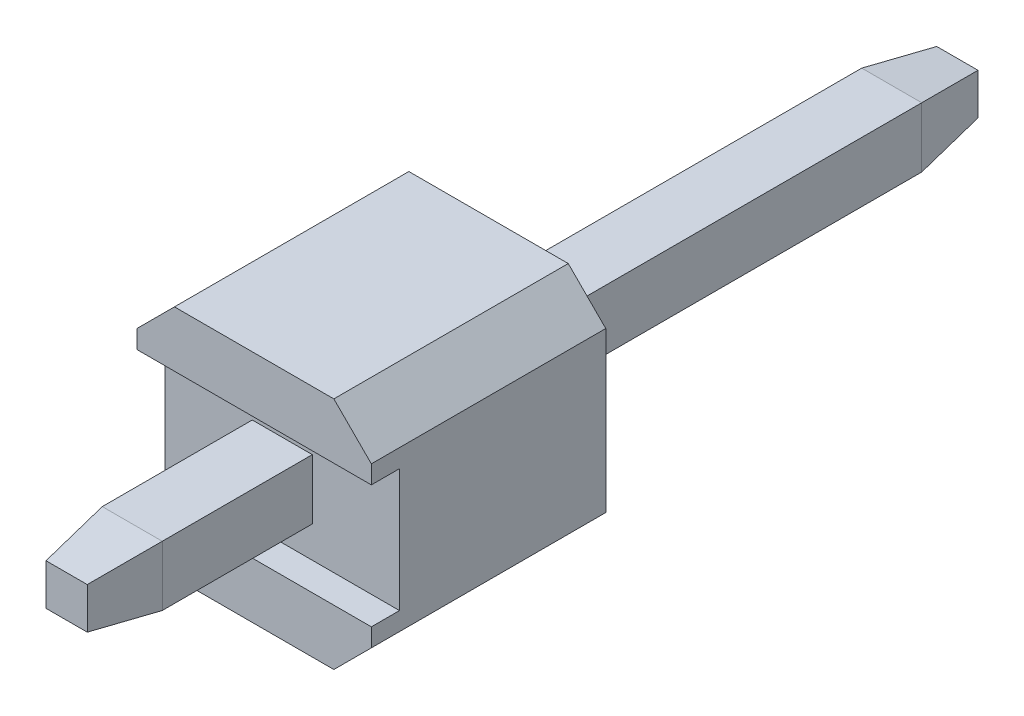
ISO-10303-21;
HEADER;
FILE_DESCRIPTION(('STEP AP214'),'2;1');
FILE_NAME('part.step','',(''),(''),'','','');
FILE_SCHEMA(('AUTOMOTIVE_DESIGN { 1 0 10303 214 1 1 1 1 }'));
ENDSEC;
DATA;
#1=APPLICATION_CONTEXT('core data for automotive mechanical design processes');
#2=APPLICATION_PROTOCOL_DEFINITION('international standard','automotive_design',2000,#1);
#3=PRODUCT_CONTEXT('',#1,'mechanical');
#4=PRODUCT('Part','Part','',(#3));
#5=PRODUCT_RELATED_PRODUCT_CATEGORY('part','',(#4));
#6=PRODUCT_DEFINITION_FORMATION('','',#4);
#7=PRODUCT_DEFINITION_CONTEXT('part definition',#1,'design');
#8=PRODUCT_DEFINITION('design','',#6,#7);
#9=PRODUCT_DEFINITION_SHAPE('','',#8);
#10=(LENGTH_UNIT() NAMED_UNIT(*) SI_UNIT(.MILLI.,.METRE.));
#11=(NAMED_UNIT(*) PLANE_ANGLE_UNIT() SI_UNIT($,.RADIAN.));
#12=(NAMED_UNIT(*) SI_UNIT($,.STERADIAN.) SOLID_ANGLE_UNIT());
#13=UNCERTAINTY_MEASURE_WITH_UNIT(LENGTH_MEASURE(1.E-05),#10,'distance_accuracy_value','');
#14=(GEOMETRIC_REPRESENTATION_CONTEXT(3) GLOBAL_UNCERTAINTY_ASSIGNED_CONTEXT((#13)) GLOBAL_UNIT_ASSIGNED_CONTEXT((#10,
#11,#12)) REPRESENTATION_CONTEXT('',''));
#15=CARTESIAN_POINT('',(0.,0.,0.));
#16=DIRECTION('',(0.,0.,1.));
#17=DIRECTION('',(1.,0.,0.));
#18=AXIS2_PLACEMENT_3D('',#15,#16,#17);
#19=CARTESIAN_POINT('',(-0.16,-0.27,-4.65));
#20=DIRECTION('',(0.,-0.989949493661167,-0.14142135623731));
#21=DIRECTION('',(0.,0.14142135623731,-0.989949493661167));
#22=AXIS2_PLACEMENT_3D('',#19,#20,#21);
#23=PLANE('',#22);
#24=DIRECTION('',(1.,0.,0.));
#25=VECTOR('',#24,1.);
#26=CARTESIAN_POINT('',(-0.16,-0.22,-5.));
#27=LINE('',#26,#25);
#28=CARTESIAN_POINT('',(-0.22,-0.22,-5.));
#29=VERTEX_POINT('',#28);
#30=CARTESIAN_POINT('',(0.22,-0.22,-5.));
#31=VERTEX_POINT('',#30);
#32=EDGE_CURVE('P0_E11',#29,#31,#27,.T.);
#33=ORIENTED_EDGE('',*,*,#32,.T.);
#34=DIRECTION('',(0.140028008402801,-0.140028008402801,0.980196058819607));
#35=VECTOR('',#34,1.);
#36=CARTESIAN_POINT('',(0.22,-0.22,-5.));
#37=LINE('',#36,#35);
#38=CARTESIAN_POINT('',(0.32,-0.32,-4.3));
#39=VERTEX_POINT('',#38);
#40=EDGE_CURVE('P0_E28',#31,#39,#37,.T.);
#41=ORIENTED_EDGE('',*,*,#40,.T.);
#42=DIRECTION('',(-1.,0.,0.));
#43=VECTOR('',#42,1.);
#44=CARTESIAN_POINT('',(-0.16,-0.32,-4.3));
#45=LINE('',#44,#43);
#46=CARTESIAN_POINT('',(-0.32,-0.32,-4.3));
#47=VERTEX_POINT('',#46);
#48=EDGE_CURVE('P0_E102',#39,#47,#45,.T.);
#49=ORIENTED_EDGE('',*,*,#48,.T.);
#50=DIRECTION('',(-0.140028008402801,-0.140028008402801,0.980196058819607));
#51=VECTOR('',#50,1.);
#52=CARTESIAN_POINT('',(-0.22,-0.22,-5.));
#53=LINE('',#52,#51);
#54=EDGE_CURVE('P0_E21',#29,#47,#53,.T.);
#55=ORIENTED_EDGE('',*,*,#54,.F.);
#56=EDGE_LOOP('',(#33,#41,#49,#55));
#57=FACE_BOUND('',#56,.T.);
#58=ADVANCED_FACE('P0_F17',(#57),#23,.T.);
#59=CARTESIAN_POINT('',(0.27,-0.16,-4.65));
#60=DIRECTION('',(0.989949493661167,0.,-0.14142135623731));
#61=DIRECTION('',(0.,-1.,0.));
#62=AXIS2_PLACEMENT_3D('',#59,#60,#61);
#63=PLANE('',#62);
#64=DIRECTION('',(0.,1.,0.));
#65=VECTOR('',#64,1.);
#66=CARTESIAN_POINT('',(0.22,-0.16,-5.));
#67=LINE('',#66,#65);
#68=CARTESIAN_POINT('',(0.22,0.22,-5.));
#69=VERTEX_POINT('',#68);
#70=EDGE_CURVE('P0_E94',#31,#69,#67,.T.);
#71=ORIENTED_EDGE('',*,*,#70,.T.);
#72=DIRECTION('',(0.140028008402801,0.140028008402801,0.980196058819607));
#73=VECTOR('',#72,1.);
#74=CARTESIAN_POINT('',(0.22,0.22,-5.));
#75=LINE('',#74,#73);
#76=CARTESIAN_POINT('',(0.32,0.32,-4.3));
#77=VERTEX_POINT('',#76);
#78=EDGE_CURVE('P0_E83',#69,#77,#75,.T.);
#79=ORIENTED_EDGE('',*,*,#78,.T.);
#80=DIRECTION('',(0.,-1.,0.));
#81=VECTOR('',#80,1.);
#82=CARTESIAN_POINT('',(0.32,-0.16,-4.3));
#83=LINE('',#82,#81);
#84=EDGE_CURVE('P0_E95',#77,#39,#83,.T.);
#85=ORIENTED_EDGE('',*,*,#84,.T.);
#86=ORIENTED_EDGE('',*,*,#40,.F.);
#87=EDGE_LOOP('',(#71,#79,#85,#86));
#88=FACE_BOUND('',#87,.T.);
#89=ADVANCED_FACE('P0_F98',(#88),#63,.T.);
#90=CARTESIAN_POINT('',(0.16,0.27,-4.65));
#91=DIRECTION('',(0.,0.989949493661167,-0.14142135623731));
#92=DIRECTION('',(-1.,0.,0.));
#93=AXIS2_PLACEMENT_3D('',#90,#91,#92);
#94=PLANE('',#93);
#95=DIRECTION('',(-1.,0.,0.));
#96=VECTOR('',#95,1.);
#97=CARTESIAN_POINT('',(0.16,0.22,-5.));
#98=LINE('',#97,#96);
#99=CARTESIAN_POINT('',(-0.22,0.22,-5.));
#100=VERTEX_POINT('',#99);
#101=EDGE_CURVE('P0_E87',#69,#100,#98,.T.);
#102=ORIENTED_EDGE('',*,*,#101,.T.);
#103=DIRECTION('',(-0.140028008402801,0.140028008402801,0.980196058819607));
#104=VECTOR('',#103,1.);
#105=CARTESIAN_POINT('',(-0.22,0.22,-5.));
#106=LINE('',#105,#104);
#107=CARTESIAN_POINT('',(-0.32,0.32,-4.3));
#108=VERTEX_POINT('',#107);
#109=EDGE_CURVE('P0_E108',#100,#108,#106,.T.);
#110=ORIENTED_EDGE('',*,*,#109,.T.);
#111=DIRECTION('',(1.,0.,0.));
#112=VECTOR('',#111,1.);
#113=CARTESIAN_POINT('',(0.16,0.32,-4.3));
#114=LINE('',#113,#112);
#115=EDGE_CURVE('P0_E90',#108,#77,#114,.T.);
#116=ORIENTED_EDGE('',*,*,#115,.T.);
#117=ORIENTED_EDGE('',*,*,#78,.F.);
#118=EDGE_LOOP('',(#102,#110,#116,#117));
#119=FACE_BOUND('',#118,.T.);
#120=ADVANCED_FACE('P0_F84',(#119),#94,.T.);
#121=CARTESIAN_POINT('',(-0.27,0.16,-4.65));
#122=DIRECTION('',(-0.989949493661167,0.,-0.14142135623731));
#123=DIRECTION('',(-0.14142135623731,0.,0.989949493661167));
#124=AXIS2_PLACEMENT_3D('',#121,#122,#123);
#125=PLANE('',#124);
#126=DIRECTION('',(0.,1.,0.));
#127=VECTOR('',#126,1.);
#128=CARTESIAN_POINT('',(-0.32,0.16,-4.3));
#129=LINE('',#128,#127);
#130=EDGE_CURVE('P0_E129',#47,#108,#129,.T.);
#131=ORIENTED_EDGE('',*,*,#130,.T.);
#132=ORIENTED_EDGE('',*,*,#109,.F.);
#133=DIRECTION('',(0.,-1.,0.));
#134=VECTOR('',#133,1.);
#135=CARTESIAN_POINT('',(-0.22,0.16,-5.));
#136=LINE('',#135,#134);
#137=EDGE_CURVE('P0_E106',#100,#29,#136,.T.);
#138=ORIENTED_EDGE('',*,*,#137,.T.);
#139=ORIENTED_EDGE('',*,*,#54,.T.);
#140=EDGE_LOOP('',(#131,#132,#138,#139));
#141=FACE_BOUND('',#140,.T.);
#142=ADVANCED_FACE('P0_F245',(#141),#125,.T.);
#143=CARTESIAN_POINT('',(-0.32,0.32,0.));
#144=DIRECTION('',(-1.,0.,0.));
#145=DIRECTION('',(0.,0.,1.));
#146=AXIS2_PLACEMENT_3D('',#143,#144,#145);
#147=PLANE('',#146);
#148=ORIENTED_EDGE('',*,*,#130,.F.);
#149=DIRECTION('',(0.,0.,1.));
#150=VECTOR('',#149,1.);
#151=CARTESIAN_POINT('',(-0.32,-0.32,0.));
#152=LINE('',#151,#150);
#153=CARTESIAN_POINT('',(-0.32,-0.32,2.));
#154=VERTEX_POINT('',#153);
#155=EDGE_CURVE('P0_E119',#47,#154,#152,.T.);
#156=ORIENTED_EDGE('',*,*,#155,.T.);
#157=DIRECTION('',(0.,-1.,0.));
#158=VECTOR('',#157,1.);
#159=CARTESIAN_POINT('',(-0.32,0.16,2.));
#160=LINE('',#159,#158);
#161=CARTESIAN_POINT('',(-0.32,0.32,2.));
#162=VERTEX_POINT('',#161);
#163=EDGE_CURVE('P0_E149',#162,#154,#160,.T.);
#164=ORIENTED_EDGE('',*,*,#163,.F.);
#165=DIRECTION('',(0.,0.,1.));
#166=VECTOR('',#165,1.);
#167=CARTESIAN_POINT('',(-0.32,0.32,0.));
#168=LINE('',#167,#166);
#169=EDGE_CURVE('P0_E126',#108,#162,#168,.T.);
#170=ORIENTED_EDGE('',*,*,#169,.F.);
#171=EDGE_LOOP('',(#148,#156,#164,#170));
#172=FACE_BOUND('',#171,.T.);
#173=ADVANCED_FACE('P0_F19',(#172),#147,.T.);
#174=CARTESIAN_POINT('',(-0.32,-0.32,0.));
#175=DIRECTION('',(0.,-1.,0.));
#176=DIRECTION('',(0.,0.,-1.));
#177=AXIS2_PLACEMENT_3D('',#174,#175,#176);
#178=PLANE('',#177);
#179=ORIENTED_EDGE('',*,*,#48,.F.);
#180=DIRECTION('',(0.,0.,1.));
#181=VECTOR('',#180,1.);
#182=CARTESIAN_POINT('',(0.32,-0.32,0.));
#183=LINE('',#182,#181);
#184=CARTESIAN_POINT('',(0.32,-0.32,2.));
#185=VERTEX_POINT('',#184);
#186=EDGE_CURVE('P0_E123',#39,#185,#183,.T.);
#187=ORIENTED_EDGE('',*,*,#186,.T.);
#188=DIRECTION('',(1.,0.,0.));
#189=VECTOR('',#188,1.);
#190=CARTESIAN_POINT('',(-0.16,-0.32,2.));
#191=LINE('',#190,#189);
#192=EDGE_CURVE('P0_E143',#154,#185,#191,.T.);
#193=ORIENTED_EDGE('',*,*,#192,.F.);
#194=ORIENTED_EDGE('',*,*,#155,.F.);
#195=EDGE_LOOP('',(#179,#187,#193,#194));
#196=FACE_BOUND('',#195,.T.);
#197=ADVANCED_FACE('P0_F236',(#196),#178,.T.);
#198=CARTESIAN_POINT('',(0.,0.,-5.));
#199=DIRECTION('',(0.,0.,-1.));
#200=DIRECTION('',(0.,-1.,0.));
#201=AXIS2_PLACEMENT_3D('',#198,#199,#200);
#202=PLANE('',#201);
#203=ORIENTED_EDGE('',*,*,#32,.F.);
#204=ORIENTED_EDGE('',*,*,#137,.F.);
#205=ORIENTED_EDGE('',*,*,#101,.F.);
#206=ORIENTED_EDGE('',*,*,#70,.F.);
#207=EDGE_LOOP('',(#203,#204,#205,#206));
#208=FACE_BOUND('',#207,.T.);
#209=ADVANCED_FACE('P0_F104',(#208),#202,.T.);
#210=CARTESIAN_POINT('',(0.32,-0.32,0.));
#211=DIRECTION('',(1.,0.,0.));
#212=DIRECTION('',(0.,1.,0.));
#213=AXIS2_PLACEMENT_3D('',#210,#211,#212);
#214=PLANE('',#213);
#215=ORIENTED_EDGE('',*,*,#84,.F.);
#216=DIRECTION('',(0.,0.,-1.));
#217=VECTOR('',#216,1.);
#218=CARTESIAN_POINT('',(0.32,0.32,0.));
#219=LINE('',#218,#217);
#220=CARTESIAN_POINT('',(0.32,0.32,2.));
#221=VERTEX_POINT('',#220);
#222=EDGE_CURVE('P0_E124',#221,#77,#219,.T.);
#223=ORIENTED_EDGE('',*,*,#222,.F.);
#224=DIRECTION('',(0.,1.,0.));
#225=VECTOR('',#224,1.);
#226=CARTESIAN_POINT('',(0.32,-0.16,2.));
#227=LINE('',#226,#225);
#228=EDGE_CURVE('P0_E140',#185,#221,#227,.T.);
#229=ORIENTED_EDGE('',*,*,#228,.F.);
#230=ORIENTED_EDGE('',*,*,#186,.F.);
#231=EDGE_LOOP('',(#215,#223,#229,#230));
#232=FACE_BOUND('',#231,.T.);
#233=ADVANCED_FACE('P0_F232',(#232),#214,.T.);
#234=CARTESIAN_POINT('',(0.32,0.32,0.));
#235=DIRECTION('',(0.,1.,0.));
#236=DIRECTION('',(1.,0.,0.));
#237=AXIS2_PLACEMENT_3D('',#234,#235,#236);
#238=PLANE('',#237);
#239=ORIENTED_EDGE('',*,*,#115,.F.);
#240=ORIENTED_EDGE('',*,*,#169,.T.);
#241=DIRECTION('',(-1.,0.,0.));
#242=VECTOR('',#241,1.);
#243=CARTESIAN_POINT('',(0.16,0.32,2.));
#244=LINE('',#243,#242);
#245=EDGE_CURVE('P0_E127',#221,#162,#244,.T.);
#246=ORIENTED_EDGE('',*,*,#245,.F.);
#247=ORIENTED_EDGE('',*,*,#222,.T.);
#248=EDGE_LOOP('',(#239,#240,#246,#247));
#249=FACE_BOUND('',#248,.T.);
#250=ADVANCED_FACE('P0_F247',(#249),#238,.T.);
#251=CARTESIAN_POINT('',(0.,0.,2.));
#252=DIRECTION('',(0.,0.,1.));
#253=DIRECTION('',(1.,0.,0.));
#254=AXIS2_PLACEMENT_3D('',#251,#252,#253);
#255=PLANE('',#254);
#256=ORIENTED_EDGE('',*,*,#245,.T.);
#257=ORIENTED_EDGE('',*,*,#163,.T.);
#258=ORIENTED_EDGE('',*,*,#192,.T.);
#259=ORIENTED_EDGE('',*,*,#228,.T.);
#260=EDGE_LOOP('',(#256,#257,#258,#259));
#261=FACE_BOUND('',#260,.T.);
#262=ADVANCED_FACE('P0_F208',(#261),#255,.T.);
#263=CLOSED_SHELL('',(#58,#89,#120,#142,#173,#197,#209,#233,#250,#262));
#264=MANIFOLD_SOLID_BREP('P0_B1',#263);
#265=CARTESIAN_POINT('',(-1.25,0.655430015301126,2.5));
#266=DIRECTION('',(0.,1.,0.));
#267=DIRECTION('',(1.,0.,0.));
#268=AXIS2_PLACEMENT_3D('',#265,#266,#267);
#269=PLANE('',#268);
#270=DIRECTION('',(1.,0.,0.));
#271=VECTOR('',#270,1.);
#272=CARTESIAN_POINT('',(-0.625,0.655430015301126,2.5));
#273=LINE('',#272,#271);
#274=CARTESIAN_POINT('',(-1.25,0.655430015301126,2.5));
#275=VERTEX_POINT('',#274);
#276=CARTESIAN_POINT('',(1.25,0.655430015301126,2.5));
#277=VERTEX_POINT('',#276);
#278=EDGE_CURVE('P1_E280',#275,#277,#273,.T.);
#279=ORIENTED_EDGE('',*,*,#278,.F.);
#280=DIRECTION('',(0.,0.,1.));
#281=VECTOR('',#280,1.);
#282=CARTESIAN_POINT('',(-1.25,0.655430015301126,1.25));
#283=LINE('',#282,#281);
#284=CARTESIAN_POINT('',(-1.25,0.655430015301126,2.2));
#285=VERTEX_POINT('',#284);
#286=EDGE_CURVE('P1_E42',#285,#275,#283,.T.);
#287=ORIENTED_EDGE('',*,*,#286,.F.);
#288=DIRECTION('',(1.,0.,0.));
#289=VECTOR('',#288,1.);
#290=CARTESIAN_POINT('',(-1.25,0.655430015301126,2.2));
#291=LINE('',#290,#289);
#292=CARTESIAN_POINT('',(1.25,0.655430015301126,2.2));
#293=VERTEX_POINT('',#292);
#294=EDGE_CURVE('P1_E11',#285,#293,#291,.T.);
#295=ORIENTED_EDGE('',*,*,#294,.T.);
#296=DIRECTION('',(0.,0.,-1.));
#297=VECTOR('',#296,1.);
#298=CARTESIAN_POINT('',(1.25,0.655430015301126,1.25));
#299=LINE('',#298,#297);
#300=EDGE_CURVE('P1_E300',#277,#293,#299,.T.);
#301=ORIENTED_EDGE('',*,*,#300,.F.);
#302=EDGE_LOOP('',(#279,#287,#295,#301));
#303=FACE_BOUND('',#302,.T.);
#304=ADVANCED_FACE('P1_F17',(#303),#269,.F.);
#305=CARTESIAN_POINT('',(1.25,-0.655430015301126,2.5));
#306=DIRECTION('',(0.,-1.,0.));
#307=DIRECTION('',(0.,0.,-1.));
#308=AXIS2_PLACEMENT_3D('',#305,#306,#307);
#309=PLANE('',#308);
#310=DIRECTION('',(-1.,0.,0.));
#311=VECTOR('',#310,1.);
#312=CARTESIAN_POINT('',(0.625,-0.655430015301126,2.5));
#313=LINE('',#312,#311);
#314=CARTESIAN_POINT('',(1.25,-0.655430015301126,2.5));
#315=VERTEX_POINT('',#314);
#316=CARTESIAN_POINT('',(-1.25,-0.655430015301126,2.5));
#317=VERTEX_POINT('',#316);
#318=EDGE_CURVE('P1_E328',#315,#317,#313,.T.);
#319=ORIENTED_EDGE('',*,*,#318,.F.);
#320=DIRECTION('',(0.,0.,1.));
#321=VECTOR('',#320,1.);
#322=CARTESIAN_POINT('',(1.25,-0.655430015301126,1.25));
#323=LINE('',#322,#321);
#324=CARTESIAN_POINT('',(1.25,-0.655430015301126,2.2));
#325=VERTEX_POINT('',#324);
#326=EDGE_CURVE('P1_E271',#325,#315,#323,.T.);
#327=ORIENTED_EDGE('',*,*,#326,.F.);
#328=DIRECTION('',(-1.,0.,0.));
#329=VECTOR('',#328,1.);
#330=CARTESIAN_POINT('',(1.25,-0.655430015301126,2.2));
#331=LINE('',#330,#329);
#332=CARTESIAN_POINT('',(-1.25,-0.655430015301126,2.2));
#333=VERTEX_POINT('',#332);
#334=EDGE_CURVE('P1_E28',#325,#333,#331,.T.);
#335=ORIENTED_EDGE('',*,*,#334,.T.);
#336=DIRECTION('',(0.,0.,-1.));
#337=VECTOR('',#336,1.);
#338=CARTESIAN_POINT('',(-1.25,-0.655430015301126,1.25));
#339=LINE('',#338,#337);
#340=EDGE_CURVE('P1_E235',#317,#333,#339,.T.);
#341=ORIENTED_EDGE('',*,*,#340,.F.);
#342=EDGE_LOOP('',(#319,#327,#335,#341));
#343=FACE_BOUND('',#342,.T.);
#344=ADVANCED_FACE('P1_F389',(#343),#309,.F.);
#345=CARTESIAN_POINT('',(0.,0.,2.2));
#346=DIRECTION('',(0.,0.,-1.));
#347=DIRECTION('',(0.,-1.,0.));
#348=AXIS2_PLACEMENT_3D('',#345,#346,#347);
#349=PLANE('',#348);
#350=DIRECTION('',(0.,-1.,0.));
#351=VECTOR('',#350,1.);
#352=CARTESIAN_POINT('',(1.25,-0.625,2.2));
#353=LINE('',#352,#351);
#354=EDGE_CURVE('P1_E312',#293,#325,#353,.T.);
#355=ORIENTED_EDGE('',*,*,#354,.F.);
#356=ORIENTED_EDGE('',*,*,#294,.F.);
#357=DIRECTION('',(0.,1.,0.));
#358=VECTOR('',#357,1.);
#359=CARTESIAN_POINT('',(-1.25,0.625,2.2));
#360=LINE('',#359,#358);
#361=EDGE_CURVE('P1_E244',#333,#285,#360,.T.);
#362=ORIENTED_EDGE('',*,*,#361,.F.);
#363=ORIENTED_EDGE('',*,*,#334,.F.);
#364=EDGE_LOOP('',(#355,#356,#362,#363));
#365=FACE_BOUND('',#364,.T.);
#366=DIRECTION('',(0.,-1.,0.));
#367=VECTOR('',#366,1.);
#368=CARTESIAN_POINT('',(-0.32,-0.16,2.2));
#369=LINE('',#368,#367);
#370=CARTESIAN_POINT('',(-0.32,0.32,2.2));
#371=VERTEX_POINT('',#370);
#372=CARTESIAN_POINT('',(-0.32,-0.32,2.2));
#373=VERTEX_POINT('',#372);
#374=EDGE_CURVE('P1_E118',#371,#373,#369,.T.);
#375=ORIENTED_EDGE('',*,*,#374,.F.);
#376=DIRECTION('',(-1.,0.,0.));
#377=VECTOR('',#376,1.);
#378=CARTESIAN_POINT('',(-0.16,0.32,2.2));
#379=LINE('',#378,#377);
#380=CARTESIAN_POINT('',(0.32,0.32,2.2));
#381=VERTEX_POINT('',#380);
#382=EDGE_CURVE('P1_E109',#381,#371,#379,.T.);
#383=ORIENTED_EDGE('',*,*,#382,.F.);
#384=DIRECTION('',(0.,1.,0.));
#385=VECTOR('',#384,1.);
#386=CARTESIAN_POINT('',(0.32,0.16,2.2));
#387=LINE('',#386,#385);
#388=CARTESIAN_POINT('',(0.32,-0.32,2.2));
#389=VERTEX_POINT('',#388);
#390=EDGE_CURVE('P1_E321',#389,#381,#387,.T.);
#391=ORIENTED_EDGE('',*,*,#390,.F.);
#392=DIRECTION('',(1.,0.,0.));
#393=VECTOR('',#392,1.);
#394=CARTESIAN_POINT('',(0.16,-0.32,2.2));
#395=LINE('',#394,#393);
#396=EDGE_CURVE('P1_E307',#373,#389,#395,.T.);
#397=ORIENTED_EDGE('',*,*,#396,.F.);
#398=EDGE_LOOP('',(#375,#383,#391,#397));
#399=FACE_BOUND('',#398,.T.);
#400=ADVANCED_FACE('P1_F386',(#365,#399),#349,.F.);
#401=CARTESIAN_POINT('',(0.,0.,2.5));
#402=DIRECTION('',(0.,0.,1.));
#403=DIRECTION('',(1.,0.,0.));
#404=AXIS2_PLACEMENT_3D('',#401,#402,#403);
#405=PLANE('',#404);
#406=ORIENTED_EDGE('',*,*,#318,.T.);
#407=DIRECTION('',(0.,-1.,0.));
#408=VECTOR('',#407,1.);
#409=CARTESIAN_POINT('',(-1.25,-1.25,2.5));
#410=LINE('',#409,#408);
#411=CARTESIAN_POINT('',(-1.25,-0.85,2.5));
#412=VERTEX_POINT('',#411);
#413=EDGE_CURVE('P1_E325',#317,#412,#410,.T.);
#414=ORIENTED_EDGE('',*,*,#413,.T.);
#415=DIRECTION('',(-0.707106781186548,0.707106781186548,0.));
#416=VECTOR('',#415,1.);
#417=CARTESIAN_POINT('',(-1.05,-1.05,2.5));
#418=LINE('',#417,#416);
#419=CARTESIAN_POINT('',(-0.85,-1.25,2.5));
#420=VERTEX_POINT('',#419);
#421=EDGE_CURVE('P1_E21',#420,#412,#418,.T.);
#422=ORIENTED_EDGE('',*,*,#421,.F.);
#423=DIRECTION('',(1.,0.,0.));
#424=VECTOR('',#423,1.);
#425=CARTESIAN_POINT('',(1.25,-1.25,2.5));
#426=LINE('',#425,#424);
#427=CARTESIAN_POINT('',(0.85,-1.25,2.5));
#428=VERTEX_POINT('',#427);
#429=EDGE_CURVE('P1_E279',#420,#428,#426,.T.);
#430=ORIENTED_EDGE('',*,*,#429,.T.);
#431=DIRECTION('',(-0.707106781186548,-0.707106781186548,0.));
#432=VECTOR('',#431,1.);
#433=CARTESIAN_POINT('',(1.05,-1.05,2.5));
#434=LINE('',#433,#432);
#435=CARTESIAN_POINT('',(1.25,-0.85,2.5));
#436=VERTEX_POINT('',#435);
#437=EDGE_CURVE('P1_E215',#436,#428,#434,.T.);
#438=ORIENTED_EDGE('',*,*,#437,.F.);
#439=DIRECTION('',(0.,1.,0.));
#440=VECTOR('',#439,1.);
#441=CARTESIAN_POINT('',(1.25,1.25,2.5));
#442=LINE('',#441,#440);
#443=EDGE_CURVE('P1_E275',#436,#315,#442,.T.);
#444=ORIENTED_EDGE('',*,*,#443,.T.);
#445=EDGE_LOOP('',(#406,#414,#422,#430,#438,#444));
#446=FACE_BOUND('',#445,.T.);
#447=ADVANCED_FACE('P1_F388',(#446),#405,.T.);
#448=CARTESIAN_POINT('',(0.,0.,2.5));
#449=DIRECTION('',(0.,0.,1.));
#450=DIRECTION('',(1.,0.,0.));
#451=AXIS2_PLACEMENT_3D('',#448,#449,#450);
#452=PLANE('',#451);
#453=ORIENTED_EDGE('',*,*,#278,.T.);
#454=DIRECTION('',(0.,1.,0.));
#455=VECTOR('',#454,1.);
#456=CARTESIAN_POINT('',(1.25,1.25,2.5));
#457=LINE('',#456,#455);
#458=CARTESIAN_POINT('',(1.25,0.85,2.5));
#459=VERTEX_POINT('',#458);
#460=EDGE_CURVE('P1_E284',#277,#459,#457,.T.);
#461=ORIENTED_EDGE('',*,*,#460,.T.);
#462=DIRECTION('',(0.707106781186548,-0.707106781186548,0.));
#463=VECTOR('',#462,1.);
#464=CARTESIAN_POINT('',(1.05,1.05,2.5));
#465=LINE('',#464,#463);
#466=CARTESIAN_POINT('',(0.85,1.25,2.5));
#467=VERTEX_POINT('',#466);
#468=EDGE_CURVE('P1_E185',#467,#459,#465,.T.);
#469=ORIENTED_EDGE('',*,*,#468,.F.);
#470=DIRECTION('',(-1.,0.,0.));
#471=VECTOR('',#470,1.);
#472=CARTESIAN_POINT('',(-1.25,1.25,2.5));
#473=LINE('',#472,#471);
#474=CARTESIAN_POINT('',(-0.85,1.25,2.5));
#475=VERTEX_POINT('',#474);
#476=EDGE_CURVE('P1_E281',#467,#475,#473,.T.);
#477=ORIENTED_EDGE('',*,*,#476,.T.);
#478=DIRECTION('',(0.707106781186548,0.707106781186548,0.));
#479=VECTOR('',#478,1.);
#480=CARTESIAN_POINT('',(-1.05,1.05,2.5));
#481=LINE('',#480,#479);
#482=CARTESIAN_POINT('',(-1.25,0.85,2.5));
#483=VERTEX_POINT('',#482);
#484=EDGE_CURVE('P1_E152',#483,#475,#481,.T.);
#485=ORIENTED_EDGE('',*,*,#484,.F.);
#486=DIRECTION('',(0.,-1.,0.));
#487=VECTOR('',#486,1.);
#488=CARTESIAN_POINT('',(-1.25,-1.25,2.5));
#489=LINE('',#488,#487);
#490=EDGE_CURVE('P1_E285',#483,#275,#489,.T.);
#491=ORIENTED_EDGE('',*,*,#490,.T.);
#492=EDGE_LOOP('',(#453,#461,#469,#477,#485,#491));
#493=FACE_BOUND('',#492,.T.);
#494=ADVANCED_FACE('P1_F19',(#493),#452,.T.);
#495=CARTESIAN_POINT('',(1.25,-1.25,0.));
#496=DIRECTION('',(1.,0.,0.));
#497=DIRECTION('',(0.,1.,0.));
#498=AXIS2_PLACEMENT_3D('',#495,#496,#497);
#499=PLANE('',#498);
#500=ORIENTED_EDGE('',*,*,#300,.T.);
#501=ORIENTED_EDGE('',*,*,#354,.T.);
#502=ORIENTED_EDGE('',*,*,#326,.T.);
#503=ORIENTED_EDGE('',*,*,#443,.F.);
#504=DIRECTION('',(0.,0.,1.));
#505=VECTOR('',#504,1.);
#506=CARTESIAN_POINT('',(1.25,-0.85,0.));
#507=LINE('',#506,#505);
#508=CARTESIAN_POINT('',(1.25,-0.85,0.));
#509=VERTEX_POINT('',#508);
#510=EDGE_CURVE('P1_E196',#509,#436,#507,.T.);
#511=ORIENTED_EDGE('',*,*,#510,.F.);
#512=DIRECTION('',(0.,-1.,0.));
#513=VECTOR('',#512,1.);
#514=CARTESIAN_POINT('',(1.25,1.25,0.));
#515=LINE('',#514,#513);
#516=CARTESIAN_POINT('',(1.25,0.85,0.));
#517=VERTEX_POINT('',#516);
#518=EDGE_CURVE('P1_E192',#517,#509,#515,.T.);
#519=ORIENTED_EDGE('',*,*,#518,.F.);
#520=DIRECTION('',(0.,0.,-1.));
#521=VECTOR('',#520,1.);
#522=CARTESIAN_POINT('',(1.25,0.85,0.));
#523=LINE('',#522,#521);
#524=EDGE_CURVE('P1_E178',#459,#517,#523,.T.);
#525=ORIENTED_EDGE('',*,*,#524,.F.);
#526=ORIENTED_EDGE('',*,*,#460,.F.);
#527=EDGE_LOOP('',(#500,#501,#502,#503,#511,#519,#525,#526));
#528=FACE_BOUND('',#527,.T.);
#529=ADVANCED_FACE('P1_F193',(#528),#499,.T.);
#530=CARTESIAN_POINT('',(0.32,0.32,0.));
#531=DIRECTION('',(-1.,0.,0.));
#532=DIRECTION('',(0.,0.,1.));
#533=AXIS2_PLACEMENT_3D('',#530,#531,#532);
#534=PLANE('',#533);
#535=ORIENTED_EDGE('',*,*,#390,.T.);
#536=DIRECTION('',(0.,0.,1.));
#537=VECTOR('',#536,1.);
#538=CARTESIAN_POINT('',(0.32,0.32,0.));
#539=LINE('',#538,#537);
#540=CARTESIAN_POINT('',(0.32,0.32,0.));
#541=VERTEX_POINT('',#540);
#542=EDGE_CURVE('P1_E313',#541,#381,#539,.T.);
#543=ORIENTED_EDGE('',*,*,#542,.F.);
#544=DIRECTION('',(0.,-1.,0.));
#545=VECTOR('',#544,1.);
#546=CARTESIAN_POINT('',(0.32,0.32,0.));
#547=LINE('',#546,#545);
#548=CARTESIAN_POINT('',(0.32,-0.32,0.));
#549=VERTEX_POINT('',#548);
#550=EDGE_CURVE('P1_E317',#541,#549,#547,.T.);
#551=ORIENTED_EDGE('',*,*,#550,.T.);
#552=DIRECTION('',(0.,0.,1.));
#553=VECTOR('',#552,1.);
#554=CARTESIAN_POINT('',(0.32,-0.32,0.));
#555=LINE('',#554,#553);
#556=EDGE_CURVE('P1_E253',#549,#389,#555,.T.);
#557=ORIENTED_EDGE('',*,*,#556,.T.);
#558=EDGE_LOOP('',(#535,#543,#551,#557));
#559=FACE_BOUND('',#558,.T.);
#560=ADVANCED_FACE('P1_F385',(#559),#534,.T.);
#561=CARTESIAN_POINT('',(-0.32,0.32,0.));
#562=DIRECTION('',(0.,-1.,0.));
#563=DIRECTION('',(0.,0.,-1.));
#564=AXIS2_PLACEMENT_3D('',#561,#562,#563);
#565=PLANE('',#564);
#566=ORIENTED_EDGE('',*,*,#382,.T.);
#567=DIRECTION('',(0.,0.,1.));
#568=VECTOR('',#567,1.);
#569=CARTESIAN_POINT('',(-0.32,0.32,0.));
#570=LINE('',#569,#568);
#571=CARTESIAN_POINT('',(-0.32,0.32,0.));
#572=VERTEX_POINT('',#571);
#573=EDGE_CURVE('P1_E224',#572,#371,#570,.T.);
#574=ORIENTED_EDGE('',*,*,#573,.F.);
#575=DIRECTION('',(1.,0.,0.));
#576=VECTOR('',#575,1.);
#577=CARTESIAN_POINT('',(-0.32,0.32,0.));
#578=LINE('',#577,#576);
#579=EDGE_CURVE('P1_E291',#572,#541,#578,.T.);
#580=ORIENTED_EDGE('',*,*,#579,.T.);
#581=ORIENTED_EDGE('',*,*,#542,.T.);
#582=EDGE_LOOP('',(#566,#574,#580,#581));
#583=FACE_BOUND('',#582,.T.);
#584=ADVANCED_FACE('P1_F373',(#583),#565,.T.);
#585=CARTESIAN_POINT('',(-1.05,-1.05,0.));
#586=DIRECTION('',(-0.707106781186548,-0.707106781186548,0.));
#587=DIRECTION('',(-0.707106781186548,0.707106781186548,0.));
#588=AXIS2_PLACEMENT_3D('',#585,#586,#587);
#589=PLANE('',#588);
#590=ORIENTED_EDGE('',*,*,#421,.T.);
#591=DIRECTION('',(0.,0.,-1.));
#592=VECTOR('',#591,1.);
#593=CARTESIAN_POINT('',(-1.25,-0.85,0.));
#594=LINE('',#593,#592);
#595=CARTESIAN_POINT('',(-1.25,-0.85,0.));
#596=VERTEX_POINT('',#595);
#597=EDGE_CURVE('P1_E229',#412,#596,#594,.T.);
#598=ORIENTED_EDGE('',*,*,#597,.T.);
#599=DIRECTION('',(0.707106781186548,-0.707106781186548,0.));
#600=VECTOR('',#599,1.);
#601=CARTESIAN_POINT('',(-1.05,-1.05,0.));
#602=LINE('',#601,#600);
#603=CARTESIAN_POINT('',(-0.85,-1.25,0.));
#604=VERTEX_POINT('',#603);
#605=EDGE_CURVE('P1_E225',#596,#604,#602,.T.);
#606=ORIENTED_EDGE('',*,*,#605,.T.);
#607=DIRECTION('',(0.,0.,1.));
#608=VECTOR('',#607,1.);
#609=CARTESIAN_POINT('',(-0.85,-1.25,0.));
#610=LINE('',#609,#608);
#611=EDGE_CURVE('P1_E230',#604,#420,#610,.T.);
#612=ORIENTED_EDGE('',*,*,#611,.T.);
#613=EDGE_LOOP('',(#590,#598,#606,#612));
#614=FACE_BOUND('',#613,.T.);
#615=ADVANCED_FACE('P1_F414',(#614),#589,.T.);
#616=CARTESIAN_POINT('',(-1.25,-1.25,0.));
#617=DIRECTION('',(0.,-1.,0.));
#618=DIRECTION('',(0.,0.,-1.));
#619=AXIS2_PLACEMENT_3D('',#616,#617,#618);
#620=PLANE('',#619);
#621=ORIENTED_EDGE('',*,*,#611,.F.);
#622=DIRECTION('',(-1.,0.,0.));
#623=VECTOR('',#622,1.);
#624=CARTESIAN_POINT('',(1.25,-1.25,0.));
#625=LINE('',#624,#623);
#626=CARTESIAN_POINT('',(0.85,-1.25,0.));
#627=VERTEX_POINT('',#626);
#628=EDGE_CURVE('P1_E202',#627,#604,#625,.T.);
#629=ORIENTED_EDGE('',*,*,#628,.F.);
#630=DIRECTION('',(0.,0.,-1.));
#631=VECTOR('',#630,1.);
#632=CARTESIAN_POINT('',(0.85,-1.25,0.));
#633=LINE('',#632,#631);
#634=EDGE_CURVE('P1_E297',#428,#627,#633,.T.);
#635=ORIENTED_EDGE('',*,*,#634,.F.);
#636=ORIENTED_EDGE('',*,*,#429,.F.);
#637=EDGE_LOOP('',(#621,#629,#635,#636));
#638=FACE_BOUND('',#637,.T.);
#639=ADVANCED_FACE('P1_F417',(#638),#620,.T.);
#640=CARTESIAN_POINT('',(0.,0.,0.));
#641=DIRECTION('',(0.,0.,1.));
#642=DIRECTION('',(1.,0.,0.));
#643=AXIS2_PLACEMENT_3D('',#640,#641,#642);
#644=PLANE('',#643);
#645=ORIENTED_EDGE('',*,*,#605,.F.);
#646=DIRECTION('',(0.,1.,0.));
#647=VECTOR('',#646,1.);
#648=CARTESIAN_POINT('',(-1.25,-1.25,0.));
#649=LINE('',#648,#647);
#650=CARTESIAN_POINT('',(-1.25,0.85,0.));
#651=VERTEX_POINT('',#650);
#652=EDGE_CURVE('P1_E255',#596,#651,#649,.T.);
#653=ORIENTED_EDGE('',*,*,#652,.T.);
#654=DIRECTION('',(-0.707106781186548,-0.707106781186548,0.));
#655=VECTOR('',#654,1.);
#656=CARTESIAN_POINT('',(-1.05,1.05,0.));
#657=LINE('',#656,#655);
#658=CARTESIAN_POINT('',(-0.85,1.25,0.));
#659=VERTEX_POINT('',#658);
#660=EDGE_CURVE('P1_E339',#659,#651,#657,.T.);
#661=ORIENTED_EDGE('',*,*,#660,.F.);
#662=DIRECTION('',(1.,0.,0.));
#663=VECTOR('',#662,1.);
#664=CARTESIAN_POINT('',(-1.25,1.25,0.));
#665=LINE('',#664,#663);
#666=CARTESIAN_POINT('',(0.85,1.25,0.));
#667=VERTEX_POINT('',#666);
#668=EDGE_CURVE('P1_E201',#659,#667,#665,.T.);
#669=ORIENTED_EDGE('',*,*,#668,.T.);
#670=DIRECTION('',(-0.707106781186548,0.707106781186548,0.));
#671=VECTOR('',#670,1.);
#672=CARTESIAN_POINT('',(1.05,1.05,0.));
#673=LINE('',#672,#671);
#674=EDGE_CURVE('P1_E183',#517,#667,#673,.T.);
#675=ORIENTED_EDGE('',*,*,#674,.F.);
#676=ORIENTED_EDGE('',*,*,#518,.T.);
#677=DIRECTION('',(0.707106781186548,0.707106781186548,0.));
#678=VECTOR('',#677,1.);
#679=CARTESIAN_POINT('',(1.05,-1.05,0.));
#680=LINE('',#679,#678);
#681=EDGE_CURVE('P1_E288',#627,#509,#680,.T.);
#682=ORIENTED_EDGE('',*,*,#681,.F.);
#683=ORIENTED_EDGE('',*,*,#628,.T.);
#684=EDGE_LOOP('',(#645,#653,#661,#669,#675,#676,#682,#683));
#685=FACE_BOUND('',#684,.T.);
#686=ORIENTED_EDGE('',*,*,#579,.F.);
#687=DIRECTION('',(0.,1.,0.));
#688=VECTOR('',#687,1.);
#689=CARTESIAN_POINT('',(-0.32,-0.32,0.));
#690=LINE('',#689,#688);
#691=CARTESIAN_POINT('',(-0.32,-0.32,0.));
#692=VERTEX_POINT('',#691);
#693=EDGE_CURVE('P1_E220',#692,#572,#690,.T.);
#694=ORIENTED_EDGE('',*,*,#693,.F.);
#695=DIRECTION('',(-1.,0.,0.));
#696=VECTOR('',#695,1.);
#697=CARTESIAN_POINT('',(0.32,-0.32,0.));
#698=LINE('',#697,#696);
#699=EDGE_CURVE('P1_E241',#549,#692,#698,.T.);
#700=ORIENTED_EDGE('',*,*,#699,.F.);
#701=ORIENTED_EDGE('',*,*,#550,.F.);
#702=EDGE_LOOP('',(#686,#694,#700,#701));
#703=FACE_BOUND('',#702,.T.);
#704=ADVANCED_FACE('P1_F204',(#685,#703),#644,.F.);
#705=CARTESIAN_POINT('',(-1.05,1.05,0.));
#706=DIRECTION('',(-0.707106781186548,0.707106781186548,0.));
#707=DIRECTION('',(0.,0.,1.));
#708=AXIS2_PLACEMENT_3D('',#705,#706,#707);
#709=PLANE('',#708);
#710=ORIENTED_EDGE('',*,*,#484,.T.);
#711=DIRECTION('',(0.,0.,-1.));
#712=VECTOR('',#711,1.);
#713=CARTESIAN_POINT('',(-0.85,1.25,0.));
#714=LINE('',#713,#712);
#715=EDGE_CURVE('P1_E303',#475,#659,#714,.T.);
#716=ORIENTED_EDGE('',*,*,#715,.T.);
#717=ORIENTED_EDGE('',*,*,#660,.T.);
#718=DIRECTION('',(0.,0.,1.));
#719=VECTOR('',#718,1.);
#720=CARTESIAN_POINT('',(-1.25,0.85,0.));
#721=LINE('',#720,#719);
#722=EDGE_CURVE('P1_E345',#651,#483,#721,.T.);
#723=ORIENTED_EDGE('',*,*,#722,.T.);
#724=EDGE_LOOP('',(#710,#716,#717,#723));
#725=FACE_BOUND('',#724,.T.);
#726=ADVANCED_FACE('P1_F406',(#725),#709,.T.);
#727=CARTESIAN_POINT('',(1.25,1.25,0.));
#728=DIRECTION('',(0.,1.,0.));
#729=DIRECTION('',(1.,0.,0.));
#730=AXIS2_PLACEMENT_3D('',#727,#728,#729);
#731=PLANE('',#730);
#732=ORIENTED_EDGE('',*,*,#715,.F.);
#733=ORIENTED_EDGE('',*,*,#476,.F.);
#734=DIRECTION('',(0.,0.,1.));
#735=VECTOR('',#734,1.);
#736=CARTESIAN_POINT('',(0.85,1.25,0.));
#737=LINE('',#736,#735);
#738=EDGE_CURVE('P1_E209',#667,#467,#737,.T.);
#739=ORIENTED_EDGE('',*,*,#738,.F.);
#740=ORIENTED_EDGE('',*,*,#668,.F.);
#741=EDGE_LOOP('',(#732,#733,#739,#740));
#742=FACE_BOUND('',#741,.T.);
#743=ADVANCED_FACE('P1_F419',(#742),#731,.T.);
#744=CARTESIAN_POINT('',(1.05,1.05,0.));
#745=DIRECTION('',(0.707106781186548,0.707106781186548,0.));
#746=DIRECTION('',(0.,0.,-1.));
#747=AXIS2_PLACEMENT_3D('',#744,#745,#746);
#748=PLANE('',#747);
#749=ORIENTED_EDGE('',*,*,#468,.T.);
#750=ORIENTED_EDGE('',*,*,#524,.T.);
#751=ORIENTED_EDGE('',*,*,#674,.T.);
#752=ORIENTED_EDGE('',*,*,#738,.T.);
#753=EDGE_LOOP('',(#749,#750,#751,#752));
#754=FACE_BOUND('',#753,.T.);
#755=ADVANCED_FACE('P1_F180',(#754),#748,.T.);
#756=CARTESIAN_POINT('',(1.05,-1.05,0.));
#757=DIRECTION('',(0.707106781186548,-0.707106781186548,0.));
#758=DIRECTION('',(0.,0.,-1.));
#759=AXIS2_PLACEMENT_3D('',#756,#757,#758);
#760=PLANE('',#759);
#761=ORIENTED_EDGE('',*,*,#437,.T.);
#762=ORIENTED_EDGE('',*,*,#634,.T.);
#763=ORIENTED_EDGE('',*,*,#681,.T.);
#764=ORIENTED_EDGE('',*,*,#510,.T.);
#765=EDGE_LOOP('',(#761,#762,#763,#764));
#766=FACE_BOUND('',#765,.T.);
#767=ADVANCED_FACE('P1_F411',(#766),#760,.T.);
#768=CARTESIAN_POINT('',(-0.32,-0.32,0.));
#769=DIRECTION('',(1.,0.,0.));
#770=DIRECTION('',(0.,1.,0.));
#771=AXIS2_PLACEMENT_3D('',#768,#769,#770);
#772=PLANE('',#771);
#773=ORIENTED_EDGE('',*,*,#374,.T.);
#774=DIRECTION('',(0.,0.,1.));
#775=VECTOR('',#774,1.);
#776=CARTESIAN_POINT('',(-0.32,-0.32,0.));
#777=LINE('',#776,#775);
#778=EDGE_CURVE('P1_E234',#692,#373,#777,.T.);
#779=ORIENTED_EDGE('',*,*,#778,.F.);
#780=ORIENTED_EDGE('',*,*,#693,.T.);
#781=ORIENTED_EDGE('',*,*,#573,.T.);
#782=EDGE_LOOP('',(#773,#779,#780,#781));
#783=FACE_BOUND('',#782,.T.);
#784=ADVANCED_FACE('P1_F379',(#783),#772,.T.);
#785=CARTESIAN_POINT('',(0.32,-0.32,0.));
#786=DIRECTION('',(0.,1.,0.));
#787=DIRECTION('',(1.,0.,0.));
#788=AXIS2_PLACEMENT_3D('',#785,#786,#787);
#789=PLANE('',#788);
#790=ORIENTED_EDGE('',*,*,#396,.T.);
#791=ORIENTED_EDGE('',*,*,#556,.F.);
#792=ORIENTED_EDGE('',*,*,#699,.T.);
#793=ORIENTED_EDGE('',*,*,#778,.T.);
#794=EDGE_LOOP('',(#790,#791,#792,#793));
#795=FACE_BOUND('',#794,.T.);
#796=ADVANCED_FACE('P1_F381',(#795),#789,.T.);
#797=CARTESIAN_POINT('',(-1.25,1.25,0.));
#798=DIRECTION('',(-1.,0.,0.));
#799=DIRECTION('',(0.,0.,1.));
#800=AXIS2_PLACEMENT_3D('',#797,#798,#799);
#801=PLANE('',#800);
#802=ORIENTED_EDGE('',*,*,#286,.T.);
#803=ORIENTED_EDGE('',*,*,#490,.F.);
#804=ORIENTED_EDGE('',*,*,#722,.F.);
#805=ORIENTED_EDGE('',*,*,#652,.F.);
#806=ORIENTED_EDGE('',*,*,#597,.F.);
#807=ORIENTED_EDGE('',*,*,#413,.F.);
#808=ORIENTED_EDGE('',*,*,#340,.T.);
#809=ORIENTED_EDGE('',*,*,#361,.T.);
#810=EDGE_LOOP('',(#802,#803,#804,#805,#806,#807,#808,#809));
#811=FACE_BOUND('',#810,.T.);
#812=ADVANCED_FACE('P1_F570',(#811),#801,.T.);
#813=CLOSED_SHELL('',(#304,#344,#400,#447,#494,#529,#560,#584,#615,#639,#704,#726,#743,#755,
#767,#784,#796,#812));
#814=MANIFOLD_SOLID_BREP('P1_B1',#813);
#815=CARTESIAN_POINT('',(0.27,-0.16,4.15));
#816=DIRECTION('',(0.989949493661167,0.,0.141421356237309));
#817=DIRECTION('',(0.,-1.,0.));
#818=AXIS2_PLACEMENT_3D('',#815,#816,#817);
#819=PLANE('',#818);
#820=DIRECTION('',(0.,-1.,0.));
#821=VECTOR('',#820,1.);
#822=CARTESIAN_POINT('',(0.22,-0.16,4.5));
#823=LINE('',#822,#821);
#824=CARTESIAN_POINT('',(0.22,0.22,4.5));
#825=VERTEX_POINT('',#824);
#826=CARTESIAN_POINT('',(0.22,-0.22,4.5));
#827=VERTEX_POINT('',#826);
#828=EDGE_CURVE('P2_E11',#825,#827,#823,.T.);
#829=ORIENTED_EDGE('',*,*,#828,.T.);
#830=DIRECTION('',(0.140028008402801,-0.140028008402801,-0.980196058819607));
#831=VECTOR('',#830,1.);
#832=CARTESIAN_POINT('',(0.22,-0.22,4.5));
#833=LINE('',#832,#831);
#834=CARTESIAN_POINT('',(0.32,-0.32,3.8));
#835=VERTEX_POINT('',#834);
#836=EDGE_CURVE('P2_E28',#827,#835,#833,.T.);
#837=ORIENTED_EDGE('',*,*,#836,.T.);
#838=DIRECTION('',(0.,1.,0.));
#839=VECTOR('',#838,1.);
#840=CARTESIAN_POINT('',(0.32,-0.16,3.8));
#841=LINE('',#840,#839);
#842=CARTESIAN_POINT('',(0.32,0.32,3.8));
#843=VERTEX_POINT('',#842);
#844=EDGE_CURVE('P2_E107',#835,#843,#841,.T.);
#845=ORIENTED_EDGE('',*,*,#844,.T.);
#846=DIRECTION('',(0.140028008402801,0.140028008402801,-0.980196058819607));
#847=VECTOR('',#846,1.);
#848=CARTESIAN_POINT('',(0.22,0.22,4.5));
#849=LINE('',#848,#847);
#850=EDGE_CURVE('P2_E151',#825,#843,#849,.T.);
#851=ORIENTED_EDGE('',*,*,#850,.F.);
#852=EDGE_LOOP('',(#829,#837,#845,#851));
#853=FACE_BOUND('',#852,.T.);
#854=ADVANCED_FACE('P2_F17',(#853),#819,.T.);
#855=CARTESIAN_POINT('',(-0.16,-0.27,4.15));
#856=DIRECTION('',(0.,-0.989949493661167,0.141421356237309));
#857=DIRECTION('',(-1.,0.,0.));
#858=AXIS2_PLACEMENT_3D('',#855,#856,#857);
#859=PLANE('',#858);
#860=DIRECTION('',(-1.,0.,0.));
#861=VECTOR('',#860,1.);
#862=CARTESIAN_POINT('',(-0.16,-0.22,4.5));
#863=LINE('',#862,#861);
#864=CARTESIAN_POINT('',(-0.22,-0.22,4.5));
#865=VERTEX_POINT('',#864);
#866=EDGE_CURVE('P2_E99',#827,#865,#863,.T.);
#867=ORIENTED_EDGE('',*,*,#866,.T.);
#868=DIRECTION('',(-0.140028008402801,-0.140028008402801,-0.980196058819607));
#869=VECTOR('',#868,1.);
#870=CARTESIAN_POINT('',(-0.22,-0.22,4.5));
#871=LINE('',#870,#869);
#872=CARTESIAN_POINT('',(-0.32,-0.32,3.8));
#873=VERTEX_POINT('',#872);
#874=EDGE_CURVE('P2_E90',#865,#873,#871,.T.);
#875=ORIENTED_EDGE('',*,*,#874,.T.);
#876=DIRECTION('',(1.,0.,0.));
#877=VECTOR('',#876,1.);
#878=CARTESIAN_POINT('',(-0.16,-0.32,3.8));
#879=LINE('',#878,#877);
#880=EDGE_CURVE('P2_E100',#873,#835,#879,.T.);
#881=ORIENTED_EDGE('',*,*,#880,.T.);
#882=ORIENTED_EDGE('',*,*,#836,.F.);
#883=EDGE_LOOP('',(#867,#875,#881,#882));
#884=FACE_BOUND('',#883,.T.);
#885=ADVANCED_FACE('P2_F103',(#884),#859,.T.);
#886=CARTESIAN_POINT('',(-0.27,0.16,4.15));
#887=DIRECTION('',(-0.989949493661167,0.,0.141421356237309));
#888=DIRECTION('',(0.,1.,0.));
#889=AXIS2_PLACEMENT_3D('',#886,#887,#888);
#890=PLANE('',#889);
#891=DIRECTION('',(0.,1.,0.));
#892=VECTOR('',#891,1.);
#893=CARTESIAN_POINT('',(-0.22,0.16,4.5));
#894=LINE('',#893,#892);
#895=CARTESIAN_POINT('',(-0.22,0.22,4.5));
#896=VERTEX_POINT('',#895);
#897=EDGE_CURVE('P2_E93',#865,#896,#894,.T.);
#898=ORIENTED_EDGE('',*,*,#897,.T.);
#899=DIRECTION('',(-0.140028008402801,0.140028008402801,-0.980196058819607));
#900=VECTOR('',#899,1.);
#901=CARTESIAN_POINT('',(-0.22,0.22,4.5));
#902=LINE('',#901,#900);
#903=CARTESIAN_POINT('',(-0.32,0.32,3.8));
#904=VERTEX_POINT('',#903);
#905=EDGE_CURVE('P2_E66',#896,#904,#902,.T.);
#906=ORIENTED_EDGE('',*,*,#905,.T.);
#907=DIRECTION('',(0.,-1.,0.));
#908=VECTOR('',#907,1.);
#909=CARTESIAN_POINT('',(-0.32,0.16,3.8));
#910=LINE('',#909,#908);
#911=EDGE_CURVE('P2_E95',#904,#873,#910,.T.);
#912=ORIENTED_EDGE('',*,*,#911,.T.);
#913=ORIENTED_EDGE('',*,*,#874,.F.);
#914=EDGE_LOOP('',(#898,#906,#912,#913));
#915=FACE_BOUND('',#914,.T.);
#916=ADVANCED_FACE('P2_F91',(#915),#890,.T.);
#917=CARTESIAN_POINT('',(0.16,0.27,4.15));
#918=DIRECTION('',(0.,0.989949493661167,0.141421356237309));
#919=DIRECTION('',(1.,0.,0.));
#920=AXIS2_PLACEMENT_3D('',#917,#918,#919);
#921=PLANE('',#920);
#922=DIRECTION('',(-1.,0.,0.));
#923=VECTOR('',#922,1.);
#924=CARTESIAN_POINT('',(0.16,0.32,3.8));
#925=LINE('',#924,#923);
#926=EDGE_CURVE('P2_E77',#843,#904,#925,.T.);
#927=ORIENTED_EDGE('',*,*,#926,.T.);
#928=ORIENTED_EDGE('',*,*,#905,.F.);
#929=DIRECTION('',(1.,0.,0.));
#930=VECTOR('',#929,1.);
#931=CARTESIAN_POINT('',(0.16,0.22,4.5));
#932=LINE('',#931,#930);
#933=EDGE_CURVE('P2_E110',#896,#825,#932,.T.);
#934=ORIENTED_EDGE('',*,*,#933,.T.);
#935=ORIENTED_EDGE('',*,*,#850,.T.);
#936=EDGE_LOOP('',(#927,#928,#934,#935));
#937=FACE_BOUND('',#936,.T.);
#938=ADVANCED_FACE('P2_F201',(#937),#921,.T.);
#939=CARTESIAN_POINT('',(0.32,0.32,2.));
#940=DIRECTION('',(0.,1.,0.));
#941=DIRECTION('',(1.,0.,0.));
#942=AXIS2_PLACEMENT_3D('',#939,#940,#941);
#943=PLANE('',#942);
#944=ORIENTED_EDGE('',*,*,#926,.F.);
#945=DIRECTION('',(0.,0.,1.));
#946=VECTOR('',#945,1.);
#947=CARTESIAN_POINT('',(0.32,0.32,2.));
#948=LINE('',#947,#946);
#949=CARTESIAN_POINT('',(0.32,0.32,2.));
#950=VERTEX_POINT('',#949);
#951=EDGE_CURVE('P2_E144',#950,#843,#948,.T.);
#952=ORIENTED_EDGE('',*,*,#951,.F.);
#953=DIRECTION('',(-1.,0.,0.));
#954=VECTOR('',#953,1.);
#955=CARTESIAN_POINT('',(0.16,0.32,2.));
#956=LINE('',#955,#954);
#957=CARTESIAN_POINT('',(-0.32,0.32,2.));
#958=VERTEX_POINT('',#957);
#959=EDGE_CURVE('P2_E136',#950,#958,#956,.T.);
#960=ORIENTED_EDGE('',*,*,#959,.T.);
#961=DIRECTION('',(0.,0.,1.));
#962=VECTOR('',#961,1.);
#963=CARTESIAN_POINT('',(-0.32,0.32,2.));
#964=LINE('',#963,#962);
#965=EDGE_CURVE('P2_E132',#958,#904,#964,.T.);
#966=ORIENTED_EDGE('',*,*,#965,.T.);
#967=EDGE_LOOP('',(#944,#952,#960,#966));
#968=FACE_BOUND('',#967,.T.);
#969=ADVANCED_FACE('P2_F163',(#968),#943,.T.);
#970=CARTESIAN_POINT('',(0.32,-0.32,2.));
#971=DIRECTION('',(1.,0.,0.));
#972=DIRECTION('',(0.,1.,0.));
#973=AXIS2_PLACEMENT_3D('',#970,#971,#972);
#974=PLANE('',#973);
#975=ORIENTED_EDGE('',*,*,#844,.F.);
#976=DIRECTION('',(0.,0.,1.));
#977=VECTOR('',#976,1.);
#978=CARTESIAN_POINT('',(0.32,-0.32,2.));
#979=LINE('',#978,#977);
#980=CARTESIAN_POINT('',(0.32,-0.32,2.));
#981=VERTEX_POINT('',#980);
#982=EDGE_CURVE('P2_E131',#981,#835,#979,.T.);
#983=ORIENTED_EDGE('',*,*,#982,.F.);
#984=DIRECTION('',(0.,1.,0.));
#985=VECTOR('',#984,1.);
#986=CARTESIAN_POINT('',(0.32,-0.16,2.));
#987=LINE('',#986,#985);
#988=EDGE_CURVE('P2_E21',#981,#950,#987,.T.);
#989=ORIENTED_EDGE('',*,*,#988,.T.);
#990=ORIENTED_EDGE('',*,*,#951,.T.);
#991=EDGE_LOOP('',(#975,#983,#989,#990));
#992=FACE_BOUND('',#991,.T.);
#993=ADVANCED_FACE('P2_F179',(#992),#974,.T.);
#994=CARTESIAN_POINT('',(0.,0.,4.5));
#995=DIRECTION('',(0.,0.,1.));
#996=DIRECTION('',(1.,0.,0.));
#997=AXIS2_PLACEMENT_3D('',#994,#995,#996);
#998=PLANE('',#997);
#999=ORIENTED_EDGE('',*,*,#828,.F.);
#1000=ORIENTED_EDGE('',*,*,#933,.F.);
#1001=ORIENTED_EDGE('',*,*,#897,.F.);
#1002=ORIENTED_EDGE('',*,*,#866,.F.);
#1003=EDGE_LOOP('',(#999,#1000,#1001,#1002));
#1004=FACE_BOUND('',#1003,.T.);
#1005=ADVANCED_FACE('P2_F109',(#1004),#998,.T.);
#1006=CARTESIAN_POINT('',(-0.32,-0.32,2.));
#1007=DIRECTION('',(0.,-1.,0.));
#1008=DIRECTION('',(0.,0.,-1.));
#1009=AXIS2_PLACEMENT_3D('',#1006,#1007,#1008);
#1010=PLANE('',#1009);
#1011=ORIENTED_EDGE('',*,*,#880,.F.);
#1012=DIRECTION('',(0.,0.,1.));
#1013=VECTOR('',#1012,1.);
#1014=CARTESIAN_POINT('',(-0.32,-0.32,2.));
#1015=LINE('',#1014,#1013);
#1016=CARTESIAN_POINT('',(-0.32,-0.32,2.));
#1017=VERTEX_POINT('',#1016);
#1018=EDGE_CURVE('P2_E124',#1017,#873,#1015,.T.);
#1019=ORIENTED_EDGE('',*,*,#1018,.F.);
#1020=DIRECTION('',(1.,0.,0.));
#1021=VECTOR('',#1020,1.);
#1022=CARTESIAN_POINT('',(-0.16,-0.32,2.));
#1023=LINE('',#1022,#1021);
#1024=EDGE_CURVE('P2_E140',#1017,#981,#1023,.T.);
#1025=ORIENTED_EDGE('',*,*,#1024,.T.);
#1026=ORIENTED_EDGE('',*,*,#982,.T.);
#1027=EDGE_LOOP('',(#1011,#1019,#1025,#1026));
#1028=FACE_BOUND('',#1027,.T.);
#1029=ADVANCED_FACE('P2_F181',(#1028),#1010,.T.);
#1030=CARTESIAN_POINT('',(-0.32,0.32,2.));
#1031=DIRECTION('',(-1.,0.,0.));
#1032=DIRECTION('',(0.,0.,1.));
#1033=AXIS2_PLACEMENT_3D('',#1030,#1031,#1032);
#1034=PLANE('',#1033);
#1035=ORIENTED_EDGE('',*,*,#911,.F.);
#1036=ORIENTED_EDGE('',*,*,#965,.F.);
#1037=DIRECTION('',(0.,-1.,0.));
#1038=VECTOR('',#1037,1.);
#1039=CARTESIAN_POINT('',(-0.32,0.16,2.));
#1040=LINE('',#1039,#1038);
#1041=EDGE_CURVE('P2_E127',#958,#1017,#1040,.T.);
#1042=ORIENTED_EDGE('',*,*,#1041,.T.);
#1043=ORIENTED_EDGE('',*,*,#1018,.T.);
#1044=EDGE_LOOP('',(#1035,#1036,#1042,#1043));
#1045=FACE_BOUND('',#1044,.T.);
#1046=ADVANCED_FACE('P2_F19',(#1045),#1034,.T.);
#1047=CARTESIAN_POINT('',(0.,0.,2.));
#1048=DIRECTION('',(0.,0.,1.));
#1049=DIRECTION('',(1.,0.,0.));
#1050=AXIS2_PLACEMENT_3D('',#1047,#1048,#1049);
#1051=PLANE('',#1050);
#1052=ORIENTED_EDGE('',*,*,#959,.F.);
#1053=ORIENTED_EDGE('',*,*,#988,.F.);
#1054=ORIENTED_EDGE('',*,*,#1024,.F.);
#1055=ORIENTED_EDGE('',*,*,#1041,.F.);
#1056=EDGE_LOOP('',(#1052,#1053,#1054,#1055));
#1057=FACE_BOUND('',#1056,.T.);
#1058=ADVANCED_FACE('P2_F168',(#1057),#1051,.F.);
#1059=CLOSED_SHELL('',(#854,#885,#916,#938,#969,#993,#1005,#1029,#1046,#1058));
#1060=MANIFOLD_SOLID_BREP('P2_B1',#1059);
#1061=ADVANCED_BREP_SHAPE_REPRESENTATION('',(#18,#264,#814,#1060),#14);
#1062=SHAPE_DEFINITION_REPRESENTATION(#9,#1061);
ENDSEC;
END-ISO-10303-21;
